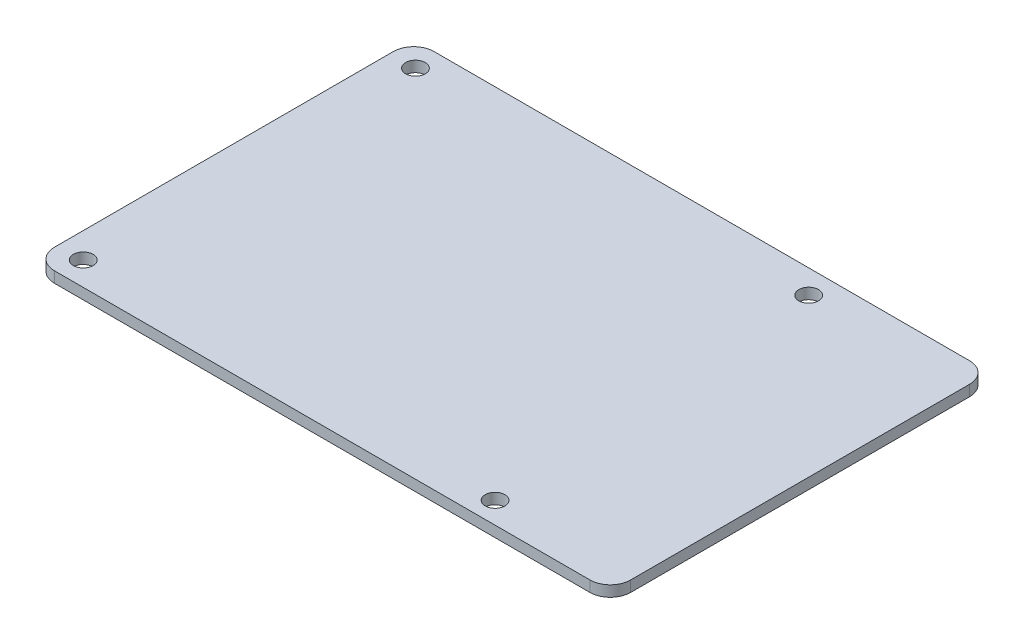
ISO-10303-21;
HEADER;
FILE_DESCRIPTION(('STEP AP214'),'2;1');
FILE_NAME('part.step','',(''),(''),'','','');
FILE_SCHEMA(('AUTOMOTIVE_DESIGN { 1 0 10303 214 1 1 1 1 }'));
ENDSEC;
DATA;
#1=APPLICATION_CONTEXT('core data for automotive mechanical design processes');
#2=APPLICATION_PROTOCOL_DEFINITION('international standard','automotive_design',2000,#1);
#3=PRODUCT_CONTEXT('',#1,'mechanical');
#4=PRODUCT('Part','Part','',(#3));
#5=PRODUCT_RELATED_PRODUCT_CATEGORY('part','',(#4));
#6=PRODUCT_DEFINITION_FORMATION('','',#4);
#7=PRODUCT_DEFINITION_CONTEXT('part definition',#1,'design');
#8=PRODUCT_DEFINITION('design','',#6,#7);
#9=PRODUCT_DEFINITION_SHAPE('','',#8);
#10=(LENGTH_UNIT() NAMED_UNIT(*) SI_UNIT(.MILLI.,.METRE.));
#11=(NAMED_UNIT(*) PLANE_ANGLE_UNIT() SI_UNIT($,.RADIAN.));
#12=(NAMED_UNIT(*) SI_UNIT($,.STERADIAN.) SOLID_ANGLE_UNIT());
#13=UNCERTAINTY_MEASURE_WITH_UNIT(LENGTH_MEASURE(1.E-05),#10,'distance_accuracy_value','');
#14=(GEOMETRIC_REPRESENTATION_CONTEXT(3) GLOBAL_UNCERTAINTY_ASSIGNED_CONTEXT((#13)) GLOBAL_UNIT_ASSIGNED_CONTEXT((#10,
#11,#12)) REPRESENTATION_CONTEXT('',''));
#15=CARTESIAN_POINT('',(0.,0.,0.));
#16=DIRECTION('',(0.,0.,1.));
#17=DIRECTION('',(1.,0.,0.));
#18=AXIS2_PLACEMENT_3D('',#15,#16,#17);
#19=CARTESIAN_POINT('',(-39.5,1.6,25.));
#20=DIRECTION('',(0.,-1.,0.));
#21=DIRECTION('',(0.,0.,-1.));
#22=AXIS2_PLACEMENT_3D('',#19,#20,#21);
#23=CYLINDRICAL_SURFACE('',#22,3.);
#24=CARTESIAN_POINT('',(-39.5,0.,25.));
#25=DIRECTION('',(0.,1.,0.));
#26=DIRECTION('',(0.,0.,1.));
#27=AXIS2_PLACEMENT_3D('',#24,#25,#26);
#28=CIRCLE('',#27,3.);
#29=CARTESIAN_POINT('',(-42.5,0.,25.));
#30=VERTEX_POINT('',#29);
#31=CARTESIAN_POINT('',(-39.5,0.,28.));
#32=VERTEX_POINT('',#31);
#33=EDGE_CURVE('E145',#30,#32,#28,.T.);
#34=ORIENTED_EDGE('',*,*,#33,.T.);
#35=DIRECTION('',(0.,-1.,0.));
#36=VECTOR('',#35,1.);
#37=CARTESIAN_POINT('',(-39.5,1.6,28.));
#38=LINE('',#37,#36);
#39=CARTESIAN_POINT('',(-39.5,1.6,28.));
#40=VERTEX_POINT('',#39);
#41=EDGE_CURVE('E13',#40,#32,#38,.T.);
#42=ORIENTED_EDGE('',*,*,#41,.F.);
#43=CARTESIAN_POINT('',(-39.5,1.6,25.));
#44=DIRECTION('',(0.,1.,0.));
#45=DIRECTION('',(0.,0.,1.));
#46=AXIS2_PLACEMENT_3D('',#43,#44,#45);
#47=CIRCLE('',#46,3.);
#48=CARTESIAN_POINT('',(-42.5,1.6,25.));
#49=VERTEX_POINT('',#48);
#50=EDGE_CURVE('E160',#49,#40,#47,.T.);
#51=ORIENTED_EDGE('',*,*,#50,.F.);
#52=DIRECTION('',(0.,-1.,0.));
#53=VECTOR('',#52,1.);
#54=CARTESIAN_POINT('',(-42.5,1.6,25.));
#55=LINE('',#54,#53);
#56=EDGE_CURVE('E141',#49,#30,#55,.T.);
#57=ORIENTED_EDGE('',*,*,#56,.T.);
#58=EDGE_LOOP('',(#34,#42,#51,#57));
#59=FACE_BOUND('',#58,.T.);
#60=ADVANCED_FACE('F49',(#59),#23,.T.);
#61=CARTESIAN_POINT('',(-39.5,1.6,28.));
#62=DIRECTION('',(0.,0.,-1.));
#63=DIRECTION('',(-1.,0.,0.));
#64=AXIS2_PLACEMENT_3D('',#61,#62,#63);
#65=PLANE('',#64);
#66=DIRECTION('',(1.,0.,0.));
#67=VECTOR('',#66,1.);
#68=CARTESIAN_POINT('',(-39.5,0.,28.));
#69=LINE('',#68,#67);
#70=CARTESIAN_POINT('',(39.5,0.,28.));
#71=VERTEX_POINT('',#70);
#72=EDGE_CURVE('E148',#32,#71,#69,.T.);
#73=ORIENTED_EDGE('',*,*,#72,.T.);
#74=DIRECTION('',(0.,-1.,0.));
#75=VECTOR('',#74,1.);
#76=CARTESIAN_POINT('',(39.5,1.6,28.));
#77=LINE('',#76,#75);
#78=CARTESIAN_POINT('',(39.5,1.6,28.));
#79=VERTEX_POINT('',#78);
#80=EDGE_CURVE('E57',#79,#71,#77,.T.);
#81=ORIENTED_EDGE('',*,*,#80,.F.);
#82=DIRECTION('',(1.,0.,0.));
#83=VECTOR('',#82,1.);
#84=CARTESIAN_POINT('',(-39.5,1.6,28.));
#85=LINE('',#84,#83);
#86=EDGE_CURVE('E108',#40,#79,#85,.T.);
#87=ORIENTED_EDGE('',*,*,#86,.F.);
#88=ORIENTED_EDGE('',*,*,#41,.T.);
#89=EDGE_LOOP('',(#73,#81,#87,#88));
#90=FACE_BOUND('',#89,.T.);
#91=ADVANCED_FACE('F245',(#90),#65,.F.);
#92=CARTESIAN_POINT('',(39.5,1.6,25.));
#93=DIRECTION('',(0.,-1.,0.));
#94=DIRECTION('',(0.,0.,-1.));
#95=AXIS2_PLACEMENT_3D('',#92,#93,#94);
#96=CYLINDRICAL_SURFACE('',#95,3.);
#97=CARTESIAN_POINT('',(39.5,0.,25.));
#98=DIRECTION('',(0.,1.,0.));
#99=DIRECTION('',(0.,0.,1.));
#100=AXIS2_PLACEMENT_3D('',#97,#98,#99);
#101=CIRCLE('',#100,3.);
#102=CARTESIAN_POINT('',(42.5,0.,25.));
#103=VERTEX_POINT('',#102);
#104=EDGE_CURVE('E151',#71,#103,#101,.T.);
#105=ORIENTED_EDGE('',*,*,#104,.T.);
#106=DIRECTION('',(0.,-1.,0.));
#107=VECTOR('',#106,1.);
#108=CARTESIAN_POINT('',(42.5,1.6,25.));
#109=LINE('',#108,#107);
#110=CARTESIAN_POINT('',(42.5,1.6,25.));
#111=VERTEX_POINT('',#110);
#112=EDGE_CURVE('E167',#111,#103,#109,.T.);
#113=ORIENTED_EDGE('',*,*,#112,.F.);
#114=CARTESIAN_POINT('',(39.5,1.6,25.));
#115=DIRECTION('',(0.,1.,0.));
#116=DIRECTION('',(0.,0.,1.));
#117=AXIS2_PLACEMENT_3D('',#114,#115,#116);
#118=CIRCLE('',#117,3.);
#119=EDGE_CURVE('E175',#79,#111,#118,.T.);
#120=ORIENTED_EDGE('',*,*,#119,.F.);
#121=ORIENTED_EDGE('',*,*,#80,.T.);
#122=EDGE_LOOP('',(#105,#113,#120,#121));
#123=FACE_BOUND('',#122,.T.);
#124=ADVANCED_FACE('F173',(#123),#96,.T.);
#125=CARTESIAN_POINT('',(42.5,1.6,-25.));
#126=DIRECTION('',(-1.,0.,0.));
#127=DIRECTION('',(0.,0.,1.));
#128=AXIS2_PLACEMENT_3D('',#125,#126,#127);
#129=PLANE('',#128);
#130=DIRECTION('',(0.,0.,-1.));
#131=VECTOR('',#130,1.);
#132=CARTESIAN_POINT('',(42.5,0.,-25.));
#133=LINE('',#132,#131);
#134=CARTESIAN_POINT('',(42.5,0.,-25.));
#135=VERTEX_POINT('',#134);
#136=EDGE_CURVE('E153',#103,#135,#133,.T.);
#137=ORIENTED_EDGE('',*,*,#136,.T.);
#138=DIRECTION('',(0.,-1.,0.));
#139=VECTOR('',#138,1.);
#140=CARTESIAN_POINT('',(42.5,1.6,-25.));
#141=LINE('',#140,#139);
#142=CARTESIAN_POINT('',(42.5,1.6,-25.));
#143=VERTEX_POINT('',#142);
#144=EDGE_CURVE('E164',#143,#135,#141,.T.);
#145=ORIENTED_EDGE('',*,*,#144,.F.);
#146=DIRECTION('',(0.,0.,-1.));
#147=VECTOR('',#146,1.);
#148=CARTESIAN_POINT('',(42.5,1.6,-25.));
#149=LINE('',#148,#147);
#150=EDGE_CURVE('E187',#111,#143,#149,.T.);
#151=ORIENTED_EDGE('',*,*,#150,.F.);
#152=ORIENTED_EDGE('',*,*,#112,.T.);
#153=EDGE_LOOP('',(#137,#145,#151,#152));
#154=FACE_BOUND('',#153,.T.);
#155=ADVANCED_FACE('F183',(#154),#129,.F.);
#156=CARTESIAN_POINT('',(39.5,1.6,-25.));
#157=DIRECTION('',(0.,-1.,0.));
#158=DIRECTION('',(0.,0.,-1.));
#159=AXIS2_PLACEMENT_3D('',#156,#157,#158);
#160=CYLINDRICAL_SURFACE('',#159,3.);
#161=CARTESIAN_POINT('',(39.5,0.,-25.));
#162=DIRECTION('',(0.,1.,0.));
#163=DIRECTION('',(0.,0.,-1.));
#164=AXIS2_PLACEMENT_3D('',#161,#162,#163);
#165=CIRCLE('',#164,3.);
#166=CARTESIAN_POINT('',(39.5,0.,-28.));
#167=VERTEX_POINT('',#166);
#168=EDGE_CURVE('E155',#135,#167,#165,.T.);
#169=ORIENTED_EDGE('',*,*,#168,.T.);
#170=DIRECTION('',(0.,-1.,0.));
#171=VECTOR('',#170,1.);
#172=CARTESIAN_POINT('',(39.5,1.6,-28.));
#173=LINE('',#172,#171);
#174=CARTESIAN_POINT('',(39.5,1.6,-28.));
#175=VERTEX_POINT('',#174);
#176=EDGE_CURVE('E136',#175,#167,#173,.T.);
#177=ORIENTED_EDGE('',*,*,#176,.F.);
#178=CARTESIAN_POINT('',(39.5,1.6,-25.));
#179=DIRECTION('',(0.,1.,0.));
#180=DIRECTION('',(0.,0.,-1.));
#181=AXIS2_PLACEMENT_3D('',#178,#179,#180);
#182=CIRCLE('',#181,3.);
#183=EDGE_CURVE('E127',#143,#175,#182,.T.);
#184=ORIENTED_EDGE('',*,*,#183,.F.);
#185=ORIENTED_EDGE('',*,*,#144,.T.);
#186=EDGE_LOOP('',(#169,#177,#184,#185));
#187=FACE_BOUND('',#186,.T.);
#188=ADVANCED_FACE('F186',(#187),#160,.T.);
#189=CARTESIAN_POINT('',(-39.5,1.6,-28.));
#190=DIRECTION('',(0.,0.,1.));
#191=DIRECTION('',(1.,0.,0.));
#192=AXIS2_PLACEMENT_3D('',#189,#190,#191);
#193=PLANE('',#192);
#194=DIRECTION('',(-1.,0.,0.));
#195=VECTOR('',#194,1.);
#196=CARTESIAN_POINT('',(-39.5,0.,-28.));
#197=LINE('',#196,#195);
#198=CARTESIAN_POINT('',(-39.5,0.,-28.));
#199=VERTEX_POINT('',#198);
#200=EDGE_CURVE('E135',#167,#199,#197,.T.);
#201=ORIENTED_EDGE('',*,*,#200,.T.);
#202=DIRECTION('',(0.,-1.,0.));
#203=VECTOR('',#202,1.);
#204=CARTESIAN_POINT('',(-39.5,1.6,-28.));
#205=LINE('',#204,#203);
#206=CARTESIAN_POINT('',(-39.5,1.6,-28.));
#207=VERTEX_POINT('',#206);
#208=EDGE_CURVE('E132',#207,#199,#205,.T.);
#209=ORIENTED_EDGE('',*,*,#208,.F.);
#210=DIRECTION('',(-1.,0.,0.));
#211=VECTOR('',#210,1.);
#212=CARTESIAN_POINT('',(-39.5,1.6,-28.));
#213=LINE('',#212,#211);
#214=EDGE_CURVE('E121',#175,#207,#213,.T.);
#215=ORIENTED_EDGE('',*,*,#214,.F.);
#216=ORIENTED_EDGE('',*,*,#176,.T.);
#217=EDGE_LOOP('',(#201,#209,#215,#216));
#218=FACE_BOUND('',#217,.T.);
#219=ADVANCED_FACE('F133',(#218),#193,.F.);
#220=CARTESIAN_POINT('',(-39.5,1.6,-25.));
#221=DIRECTION('',(0.,-1.,0.));
#222=DIRECTION('',(0.,0.,-1.));
#223=AXIS2_PLACEMENT_3D('',#220,#221,#222);
#224=CYLINDRICAL_SURFACE('',#223,3.);
#225=CARTESIAN_POINT('',(-39.5,0.,-25.));
#226=DIRECTION('',(0.,1.,0.));
#227=DIRECTION('',(0.,0.,1.));
#228=AXIS2_PLACEMENT_3D('',#225,#226,#227);
#229=CIRCLE('',#228,3.);
#230=CARTESIAN_POINT('',(-42.5,0.,-25.));
#231=VERTEX_POINT('',#230);
#232=EDGE_CURVE('E94',#199,#231,#229,.T.);
#233=ORIENTED_EDGE('',*,*,#232,.T.);
#234=DIRECTION('',(0.,-1.,0.));
#235=VECTOR('',#234,1.);
#236=CARTESIAN_POINT('',(-42.5,1.6,-25.));
#237=LINE('',#236,#235);
#238=CARTESIAN_POINT('',(-42.5,1.6,-25.));
#239=VERTEX_POINT('',#238);
#240=EDGE_CURVE('E137',#239,#231,#237,.T.);
#241=ORIENTED_EDGE('',*,*,#240,.F.);
#242=CARTESIAN_POINT('',(-39.5,1.6,-25.));
#243=DIRECTION('',(0.,1.,0.));
#244=DIRECTION('',(0.,0.,1.));
#245=AXIS2_PLACEMENT_3D('',#242,#243,#244);
#246=CIRCLE('',#245,3.);
#247=EDGE_CURVE('E125',#207,#239,#246,.T.);
#248=ORIENTED_EDGE('',*,*,#247,.F.);
#249=ORIENTED_EDGE('',*,*,#208,.T.);
#250=EDGE_LOOP('',(#233,#241,#248,#249));
#251=FACE_BOUND('',#250,.T.);
#252=ADVANCED_FACE('F139',(#251),#224,.T.);
#253=CARTESIAN_POINT('',(-42.5,1.6,-25.));
#254=DIRECTION('',(1.,0.,0.));
#255=DIRECTION('',(0.,0.,-1.));
#256=AXIS2_PLACEMENT_3D('',#253,#254,#255);
#257=PLANE('',#256);
#258=DIRECTION('',(0.,0.,1.));
#259=VECTOR('',#258,1.);
#260=CARTESIAN_POINT('',(-42.5,0.,-25.));
#261=LINE('',#260,#259);
#262=EDGE_CURVE('E100',#231,#30,#261,.T.);
#263=ORIENTED_EDGE('',*,*,#262,.T.);
#264=ORIENTED_EDGE('',*,*,#56,.F.);
#265=DIRECTION('',(0.,0.,1.));
#266=VECTOR('',#265,1.);
#267=CARTESIAN_POINT('',(-42.5,1.6,-25.));
#268=LINE('',#267,#266);
#269=EDGE_CURVE('E65',#239,#49,#268,.T.);
#270=ORIENTED_EDGE('',*,*,#269,.F.);
#271=ORIENTED_EDGE('',*,*,#240,.T.);
#272=EDGE_LOOP('',(#263,#264,#270,#271));
#273=FACE_BOUND('',#272,.T.);
#274=ADVANCED_FACE('F221',(#273),#257,.F.);
#275=CARTESIAN_POINT('',(-39.5,1.6,25.));
#276=DIRECTION('',(0.,1.,0.));
#277=DIRECTION('',(0.,0.,1.));
#278=AXIS2_PLACEMENT_3D('',#275,#276,#277);
#279=PLANE('',#278);
#280=CARTESIAN_POINT('',(-38.7427842274662,1.6,-24.5));
#281=DIRECTION('',(0.,1.,0.));
#282=DIRECTION('',(0.,0.,1.));
#283=AXIS2_PLACEMENT_3D('',#280,#281,#282);
#284=CIRCLE('',#283,1.44999999999999);
#285=CARTESIAN_POINT('',(-38.7427842274662,1.6,-23.05));
#286=VERTEX_POINT('',#285);
#287=EDGE_CURVE('E213',#286,#286,#284,.T.);
#288=ORIENTED_EDGE('',*,*,#287,.F.);
#289=EDGE_LOOP('',(#288));
#290=FACE_BOUND('',#289,.T.);
#291=CARTESIAN_POINT('',(19.2572157725338,1.6,-24.5));
#292=DIRECTION('',(0.,1.,0.));
#293=DIRECTION('',(0.,0.,1.));
#294=AXIS2_PLACEMENT_3D('',#291,#292,#293);
#295=CIRCLE('',#294,1.44999999999999);
#296=CARTESIAN_POINT('',(19.2572157725338,1.6,-23.05));
#297=VERTEX_POINT('',#296);
#298=EDGE_CURVE('E207',#297,#297,#295,.T.);
#299=ORIENTED_EDGE('',*,*,#298,.F.);
#300=EDGE_LOOP('',(#299));
#301=FACE_BOUND('',#300,.T.);
#302=CARTESIAN_POINT('',(22.3268625425384,1.6,24.8249189925936));
#303=DIRECTION('',(0.,1.,0.));
#304=DIRECTION('',(0.,0.,1.));
#305=AXIS2_PLACEMENT_3D('',#302,#303,#304);
#306=CIRCLE('',#305,1.44999999999999);
#307=CARTESIAN_POINT('',(22.3268625425384,1.6,26.2749189925936));
#308=VERTEX_POINT('',#307);
#309=EDGE_CURVE('E201',#308,#308,#306,.T.);
#310=ORIENTED_EDGE('',*,*,#309,.F.);
#311=EDGE_LOOP('',(#310));
#312=FACE_BOUND('',#311,.T.);
#313=CARTESIAN_POINT('',(-38.7427842274662,1.6,24.5));
#314=DIRECTION('',(0.,1.,0.));
#315=DIRECTION('',(0.,0.,1.));
#316=AXIS2_PLACEMENT_3D('',#313,#314,#315);
#317=CIRCLE('',#316,1.44999999999999);
#318=CARTESIAN_POINT('',(-38.7427842274662,1.6,25.95));
#319=VERTEX_POINT('',#318);
#320=EDGE_CURVE('E195',#319,#319,#317,.T.);
#321=ORIENTED_EDGE('',*,*,#320,.F.);
#322=EDGE_LOOP('',(#321));
#323=FACE_BOUND('',#322,.T.);
#324=ORIENTED_EDGE('',*,*,#50,.T.);
#325=ORIENTED_EDGE('',*,*,#86,.T.);
#326=ORIENTED_EDGE('',*,*,#119,.T.);
#327=ORIENTED_EDGE('',*,*,#150,.T.);
#328=ORIENTED_EDGE('',*,*,#183,.T.);
#329=ORIENTED_EDGE('',*,*,#214,.T.);
#330=ORIENTED_EDGE('',*,*,#247,.T.);
#331=ORIENTED_EDGE('',*,*,#269,.T.);
#332=EDGE_LOOP('',(#324,#325,#326,#327,#328,#329,#330,#331));
#333=FACE_BOUND('',#332,.T.);
#334=ADVANCED_FACE('F123',(#290,#301,#312,#323,#333),#279,.T.);
#335=CARTESIAN_POINT('',(-39.5,0.,25.));
#336=DIRECTION('',(0.,1.,0.));
#337=DIRECTION('',(0.,0.,1.));
#338=AXIS2_PLACEMENT_3D('',#335,#336,#337);
#339=PLANE('',#338);
#340=CARTESIAN_POINT('',(-38.7427842274662,0.,-24.5));
#341=DIRECTION('',(0.,1.,0.));
#342=DIRECTION('',(0.,0.,1.));
#343=AXIS2_PLACEMENT_3D('',#340,#341,#342);
#344=CIRCLE('',#343,1.44999999999999);
#345=CARTESIAN_POINT('',(-38.7427842274662,0.,-23.05));
#346=VERTEX_POINT('',#345);
#347=EDGE_CURVE('E210',#346,#346,#344,.T.);
#348=ORIENTED_EDGE('',*,*,#347,.T.);
#349=EDGE_LOOP('',(#348));
#350=FACE_BOUND('',#349,.T.);
#351=CARTESIAN_POINT('',(19.2572157725338,0.,-24.5));
#352=DIRECTION('',(0.,1.,0.));
#353=DIRECTION('',(0.,0.,1.));
#354=AXIS2_PLACEMENT_3D('',#351,#352,#353);
#355=CIRCLE('',#354,1.44999999999999);
#356=CARTESIAN_POINT('',(19.2572157725338,0.,-23.05));
#357=VERTEX_POINT('',#356);
#358=EDGE_CURVE('E204',#357,#357,#355,.T.);
#359=ORIENTED_EDGE('',*,*,#358,.T.);
#360=EDGE_LOOP('',(#359));
#361=FACE_BOUND('',#360,.T.);
#362=CARTESIAN_POINT('',(22.3268625425384,0.,24.8249189925936));
#363=DIRECTION('',(0.,1.,0.));
#364=DIRECTION('',(0.,0.,1.));
#365=AXIS2_PLACEMENT_3D('',#362,#363,#364);
#366=CIRCLE('',#365,1.44999999999999);
#367=CARTESIAN_POINT('',(22.3268625425384,0.,26.2749189925936));
#368=VERTEX_POINT('',#367);
#369=EDGE_CURVE('E198',#368,#368,#366,.T.);
#370=ORIENTED_EDGE('',*,*,#369,.T.);
#371=EDGE_LOOP('',(#370));
#372=FACE_BOUND('',#371,.T.);
#373=CARTESIAN_POINT('',(-38.7427842274662,0.,24.5));
#374=DIRECTION('',(0.,1.,0.));
#375=DIRECTION('',(0.,0.,1.));
#376=AXIS2_PLACEMENT_3D('',#373,#374,#375);
#377=CIRCLE('',#376,1.44999999999999);
#378=CARTESIAN_POINT('',(-38.7427842274662,0.,25.95));
#379=VERTEX_POINT('',#378);
#380=EDGE_CURVE('E149',#379,#379,#377,.T.);
#381=ORIENTED_EDGE('',*,*,#380,.T.);
#382=EDGE_LOOP('',(#381));
#383=FACE_BOUND('',#382,.T.);
#384=ORIENTED_EDGE('',*,*,#33,.F.);
#385=ORIENTED_EDGE('',*,*,#262,.F.);
#386=ORIENTED_EDGE('',*,*,#232,.F.);
#387=ORIENTED_EDGE('',*,*,#200,.F.);
#388=ORIENTED_EDGE('',*,*,#168,.F.);
#389=ORIENTED_EDGE('',*,*,#136,.F.);
#390=ORIENTED_EDGE('',*,*,#104,.F.);
#391=ORIENTED_EDGE('',*,*,#72,.F.);
#392=EDGE_LOOP('',(#384,#385,#386,#387,#388,#389,#390,#391));
#393=FACE_BOUND('',#392,.T.);
#394=ADVANCED_FACE('F179',(#350,#361,#372,#383,#393),#339,.F.);
#395=CARTESIAN_POINT('',(-38.7427842274662,1.6,24.5));
#396=DIRECTION('',(0.,1.,0.));
#397=DIRECTION('',(0.,0.,1.));
#398=AXIS2_PLACEMENT_3D('',#395,#396,#397);
#399=CYLINDRICAL_SURFACE('',#398,1.44999999999999);
#400=ORIENTED_EDGE('',*,*,#380,.F.);
#401=EDGE_LOOP('',(#400));
#402=FACE_BOUND('',#401,.T.);
#403=ORIENTED_EDGE('',*,*,#320,.T.);
#404=EDGE_LOOP('',(#403));
#405=FACE_BOUND('',#404,.T.);
#406=ADVANCED_FACE('F229',(#402,#405),#399,.F.);
#407=CARTESIAN_POINT('',(22.3268625425384,1.6,24.8249189925936));
#408=DIRECTION('',(0.,1.,0.));
#409=DIRECTION('',(0.,0.,1.));
#410=AXIS2_PLACEMENT_3D('',#407,#408,#409);
#411=CYLINDRICAL_SURFACE('',#410,1.44999999999999);
#412=ORIENTED_EDGE('',*,*,#369,.F.);
#413=EDGE_LOOP('',(#412));
#414=FACE_BOUND('',#413,.T.);
#415=ORIENTED_EDGE('',*,*,#309,.T.);
#416=EDGE_LOOP('',(#415));
#417=FACE_BOUND('',#416,.T.);
#418=ADVANCED_FACE('F231',(#414,#417),#411,.F.);
#419=CARTESIAN_POINT('',(19.2572157725338,1.6,-24.5));
#420=DIRECTION('',(0.,1.,0.));
#421=DIRECTION('',(0.,0.,1.));
#422=AXIS2_PLACEMENT_3D('',#419,#420,#421);
#423=CYLINDRICAL_SURFACE('',#422,1.44999999999999);
#424=ORIENTED_EDGE('',*,*,#358,.F.);
#425=EDGE_LOOP('',(#424));
#426=FACE_BOUND('',#425,.T.);
#427=ORIENTED_EDGE('',*,*,#298,.T.);
#428=EDGE_LOOP('',(#427));
#429=FACE_BOUND('',#428,.T.);
#430=ADVANCED_FACE('F238',(#426,#429),#423,.F.);
#431=CARTESIAN_POINT('',(-38.7427842274662,1.6,-24.5));
#432=DIRECTION('',(0.,1.,0.));
#433=DIRECTION('',(0.,0.,1.));
#434=AXIS2_PLACEMENT_3D('',#431,#432,#433);
#435=CYLINDRICAL_SURFACE('',#434,1.44999999999999);
#436=ORIENTED_EDGE('',*,*,#347,.F.);
#437=EDGE_LOOP('',(#436));
#438=FACE_BOUND('',#437,.T.);
#439=ORIENTED_EDGE('',*,*,#287,.T.);
#440=EDGE_LOOP('',(#439));
#441=FACE_BOUND('',#440,.T.);
#442=ADVANCED_FACE('F217',(#438,#441),#435,.F.);
#443=CLOSED_SHELL('',(#60,#91,#124,#155,#188,#219,#252,#274,#334,#394,#406,#418,#430,#442));
#444=MANIFOLD_SOLID_BREP('B2',#443);
#445=ADVANCED_BREP_SHAPE_REPRESENTATION('',(#18,#444),#14);
#446=SHAPE_DEFINITION_REPRESENTATION(#9,#445);
ENDSEC;
END-ISO-10303-21;
